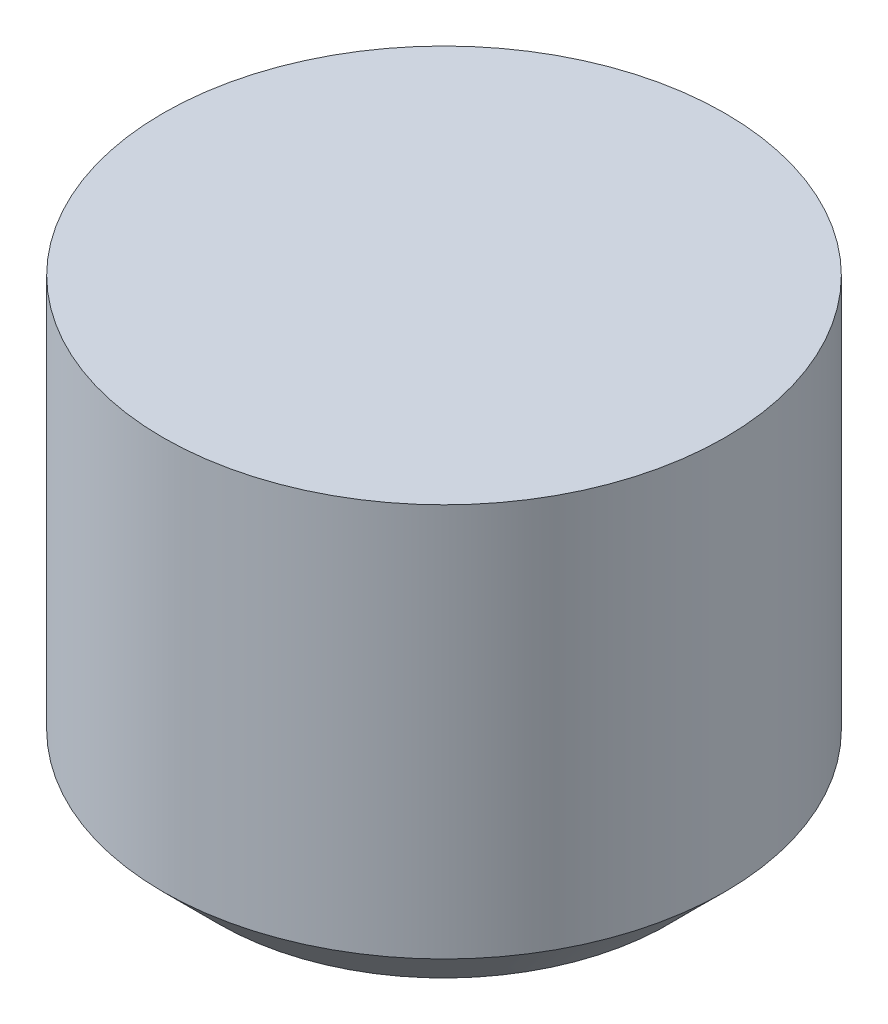
ISO-10303-21;
HEADER;
FILE_DESCRIPTION(('STEP AP214'),'2;1');
FILE_NAME('part.step','',(''),(''),'','','');
FILE_SCHEMA(('AUTOMOTIVE_DESIGN { 1 0 10303 214 1 1 1 1 }'));
ENDSEC;
DATA;
#1=APPLICATION_CONTEXT('core data for automotive mechanical design processes');
#2=APPLICATION_PROTOCOL_DEFINITION('international standard','automotive_design',2000,#1);
#3=PRODUCT_CONTEXT('',#1,'mechanical');
#4=PRODUCT('Part','Part','',(#3));
#5=PRODUCT_RELATED_PRODUCT_CATEGORY('part','',(#4));
#6=PRODUCT_DEFINITION_FORMATION('','',#4);
#7=PRODUCT_DEFINITION_CONTEXT('part definition',#1,'design');
#8=PRODUCT_DEFINITION('design','',#6,#7);
#9=PRODUCT_DEFINITION_SHAPE('','',#8);
#10=(LENGTH_UNIT() NAMED_UNIT(*) SI_UNIT(.MILLI.,.METRE.));
#11=(NAMED_UNIT(*) PLANE_ANGLE_UNIT() SI_UNIT($,.RADIAN.));
#12=(NAMED_UNIT(*) SI_UNIT($,.STERADIAN.) SOLID_ANGLE_UNIT());
#13=UNCERTAINTY_MEASURE_WITH_UNIT(LENGTH_MEASURE(1.E-05),#10,'distance_accuracy_value','');
#14=(GEOMETRIC_REPRESENTATION_CONTEXT(3) GLOBAL_UNCERTAINTY_ASSIGNED_CONTEXT((#13)) GLOBAL_UNIT_ASSIGNED_CONTEXT((#10,
#11,#12)) REPRESENTATION_CONTEXT('',''));
#15=CARTESIAN_POINT('',(0.,0.,0.));
#16=DIRECTION('',(0.,0.,1.));
#17=DIRECTION('',(1.,0.,0.));
#18=AXIS2_PLACEMENT_3D('',#15,#16,#17);
#19=CARTESIAN_POINT('',(0.,-2.,0.));
#20=DIRECTION('',(0.,1.,0.));
#21=DIRECTION('',(0.,0.,1.));
#22=AXIS2_PLACEMENT_3D('',#19,#20,#21);
#23=PLANE('',#22);
#24=CARTESIAN_POINT('',(0.,-2.00000000000955,0.));
#25=DIRECTION('',(0.,1.,0.));
#26=DIRECTION('',(0.,0.,1.));
#27=AXIS2_PLACEMENT_3D('',#24,#25,#26);
#28=CIRCLE('',#27,2.00000000000955);
#29=CARTESIAN_POINT('',(0.,-2.00000000000955,2.00000000000955));
#30=VERTEX_POINT('',#29);
#31=EDGE_CURVE('E18',#30,#30,#28,.T.);
#32=ORIENTED_EDGE('',*,*,#31,.F.);
#33=EDGE_LOOP('',(#32));
#34=FACE_BOUND('',#33,.T.);
#35=ADVANCED_FACE('F15',(#34),#23,.F.);
#36=CARTESIAN_POINT('',(0.,-1.50000000007822,0.));
#37=DIRECTION('',(0.,1.,0.));
#38=DIRECTION('',(0.,0.,1.));
#39=AXIS2_PLACEMENT_3D('',#36,#37,#38);
#40=CONICAL_SURFACE('',#39,2.49999999994088,0.785398163397448);
#41=ORIENTED_EDGE('',*,*,#31,.T.);
#42=EDGE_LOOP('',(#41));
#43=FACE_BOUND('',#42,.T.);
#44=CARTESIAN_POINT('',(0.,-1.5,0.));
#45=DIRECTION('',(0.,-1.,0.));
#46=DIRECTION('',(0.,0.,-1.));
#47=AXIS2_PLACEMENT_3D('',#44,#45,#46);
#48=CIRCLE('',#47,2.5);
#49=CARTESIAN_POINT('',(0.,-1.5,-2.5));
#50=VERTEX_POINT('',#49);
#51=EDGE_CURVE('E22',#50,#50,#48,.F.);
#52=ORIENTED_EDGE('',*,*,#51,.F.);
#53=EDGE_LOOP('',(#52));
#54=FACE_BOUND('',#53,.T.);
#55=ADVANCED_FACE('F32',(#43,#54),#40,.T.);
#56=CARTESIAN_POINT('',(0.,2.,0.));
#57=DIRECTION('',(0.,1.,0.));
#58=DIRECTION('',(0.,0.,1.));
#59=AXIS2_PLACEMENT_3D('',#56,#57,#58);
#60=PLANE('',#59);
#61=CARTESIAN_POINT('',(0.,2.,0.));
#62=DIRECTION('',(0.,-1.,0.));
#63=DIRECTION('',(0.,0.,-1.));
#64=AXIS2_PLACEMENT_3D('',#61,#62,#63);
#65=CIRCLE('',#64,2.5);
#66=CARTESIAN_POINT('',(0.,2.,-2.5));
#67=VERTEX_POINT('',#66);
#68=EDGE_CURVE('E10',#67,#67,#65,.T.);
#69=ORIENTED_EDGE('',*,*,#68,.F.);
#70=EDGE_LOOP('',(#69));
#71=FACE_BOUND('',#70,.T.);
#72=ADVANCED_FACE('F40',(#71),#60,.T.);
#73=CARTESIAN_POINT('',(0.,2.,0.));
#74=DIRECTION('',(0.,-1.,0.));
#75=DIRECTION('',(0.,0.,-1.));
#76=AXIS2_PLACEMENT_3D('',#73,#74,#75);
#77=CYLINDRICAL_SURFACE('',#76,2.5);
#78=ORIENTED_EDGE('',*,*,#51,.T.);
#79=EDGE_LOOP('',(#78));
#80=FACE_BOUND('',#79,.T.);
#81=ORIENTED_EDGE('',*,*,#68,.T.);
#82=EDGE_LOOP('',(#81));
#83=FACE_BOUND('',#82,.T.);
#84=ADVANCED_FACE('F41',(#80,#83),#77,.T.);
#85=CLOSED_SHELL('',(#35,#55,#72,#84));
#86=MANIFOLD_SOLID_BREP('B1',#85);
#87=ADVANCED_BREP_SHAPE_REPRESENTATION('',(#18,#86),#14);
#88=SHAPE_DEFINITION_REPRESENTATION(#9,#87);
ENDSEC;
END-ISO-10303-21;
